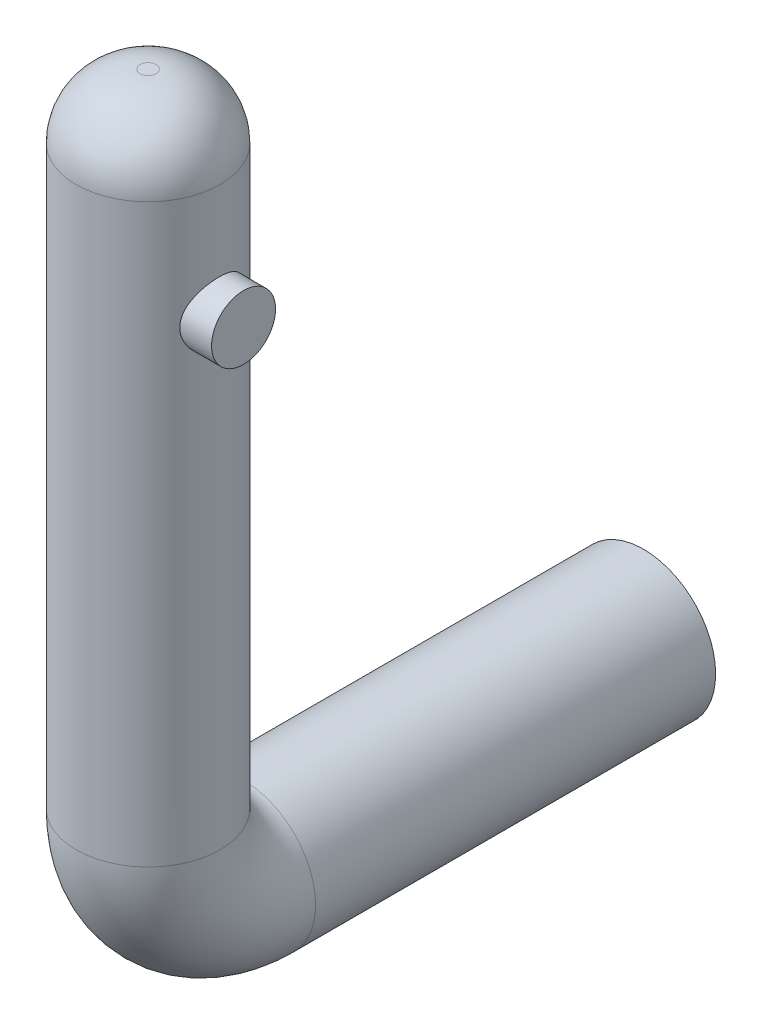
ISO-10303-21;
HEADER;
FILE_DESCRIPTION(('STEP AP214'),'2;1');
FILE_NAME('part.step','',(''),(''),'','','');
FILE_SCHEMA(('AUTOMOTIVE_DESIGN { 1 0 10303 214 1 1 1 1 }'));
ENDSEC;
DATA;
#1=APPLICATION_CONTEXT('core data for automotive mechanical design processes');
#2=APPLICATION_PROTOCOL_DEFINITION('international standard','automotive_design',2000,#1);
#3=PRODUCT_CONTEXT('',#1,'mechanical');
#4=PRODUCT('Part','Part','',(#3));
#5=PRODUCT_RELATED_PRODUCT_CATEGORY('part','',(#4));
#6=PRODUCT_DEFINITION_FORMATION('','',#4);
#7=PRODUCT_DEFINITION_CONTEXT('part definition',#1,'design');
#8=PRODUCT_DEFINITION('design','',#6,#7);
#9=PRODUCT_DEFINITION_SHAPE('','',#8);
#10=(LENGTH_UNIT() NAMED_UNIT(*) SI_UNIT(.MILLI.,.METRE.));
#11=(NAMED_UNIT(*) PLANE_ANGLE_UNIT() SI_UNIT($,.RADIAN.));
#12=(NAMED_UNIT(*) SI_UNIT($,.STERADIAN.) SOLID_ANGLE_UNIT());
#13=UNCERTAINTY_MEASURE_WITH_UNIT(LENGTH_MEASURE(1.E-05),#10,'distance_accuracy_value','');
#14=(GEOMETRIC_REPRESENTATION_CONTEXT(3) GLOBAL_UNCERTAINTY_ASSIGNED_CONTEXT((#13)) GLOBAL_UNIT_ASSIGNED_CONTEXT((#10,
#11,#12)) REPRESENTATION_CONTEXT('',''));
#15=CARTESIAN_POINT('',(0.,0.,0.));
#16=DIRECTION('',(0.,0.,1.));
#17=DIRECTION('',(1.,0.,0.));
#18=AXIS2_PLACEMENT_3D('',#15,#16,#17);
#19=CARTESIAN_POINT('',(0.,5.96477448449233,30.9647744844923));
#20=DIRECTION('',(0.,1.,0.));
#21=DIRECTION('',(0.,0.,1.));
#22=AXIS2_PLACEMENT_3D('',#19,#20,#21);
#23=CYLINDRICAL_SURFACE('',#22,4.5);
#24=CARTESIAN_POINT('',(0.,5.96477448449233,30.9647744844923));
#25=DIRECTION('',(0.,1.,0.));
#26=DIRECTION('',(1.,0.,0.));
#27=AXIS2_PLACEMENT_3D('',#24,#25,#26);
#28=CIRCLE('',#27,4.5);
#29=CARTESIAN_POINT('',(0.,5.96477448449233,35.4647744844923));
#30=VERTEX_POINT('',#29);
#31=EDGE_CURVE('E56',#30,#30,#28,.T.);
#32=ORIENTED_EDGE('',*,*,#31,.T.);
#33=EDGE_LOOP('',(#32));
#34=FACE_BOUND('',#33,.T.);
#35=CARTESIAN_POINT('',(0.,41.9647744844923,30.9647744844923));
#36=DIRECTION('',(0.,1.,0.));
#37=DIRECTION('',(0.,0.,1.));
#38=AXIS2_PLACEMENT_3D('',#35,#36,#37);
#39=CIRCLE('',#38,4.5);
#40=CARTESIAN_POINT('',(0.,41.9647744844923,35.4647744844923));
#41=VERTEX_POINT('',#40);
#42=EDGE_CURVE('E10',#41,#41,#39,.F.);
#43=ORIENTED_EDGE('',*,*,#42,.T.);
#44=EDGE_LOOP('',(#43));
#45=FACE_BOUND('',#44,.T.);
#46=CARTESIAN_POINT('',(4.01345949288473,35.,33.));
#47=CARTESIAN_POINT('',(4.01346519462913,35.1056364135838,32.9999948387698));
#48=CARTESIAN_POINT('',(4.01776516168621,35.2114449167085,32.9915765566745));
#49=CARTESIAN_POINT('',(4.03438581277662,35.4199359214425,32.958278942159));
#50=CARTESIAN_POINT('',(4.04672694018069,35.5226097552481,32.9333576508216));
#51=CARTESIAN_POINT('',(4.07774320827353,35.7214302992945,32.868268919712));
#52=CARTESIAN_POINT('',(4.09638931034859,35.8176045505512,32.8281712779045));
#53=CARTESIAN_POINT('',(4.13789521433156,36.0018278148005,32.7340844491881));
#54=CARTESIAN_POINT('',(4.16075443342319,36.0898779491078,32.6800971832745));
#55=CARTESIAN_POINT('',(4.2100156552549,36.2618644675177,32.5555409568229));
#56=CARTESIAN_POINT('',(4.23655222027747,36.3451361227007,32.4841069997539));
#57=CARTESIAN_POINT('',(4.28917057031154,36.4990184527393,32.3285047324037));
#58=CARTESIAN_POINT('',(4.31525215157186,36.569623580319,32.2443308723194));
#59=CARTESIAN_POINT('',(4.36577092335343,36.699906771846,32.0600575214527));
#60=CARTESIAN_POINT('',(4.39004188048354,36.7587831445575,31.959341391537));
#61=CARTESIAN_POINT('',(4.43259309406328,36.8584591189288,31.7481592454407));
#62=CARTESIAN_POINT('',(4.45087629601152,36.8992676120335,31.6376980571023));
#63=CARTESIAN_POINT('',(4.47853346047371,36.9592186662978,31.4168775089949));
#64=CARTESIAN_POINT('',(4.48835934424051,36.9794723169487,31.3068776708476));
#65=CARTESIAN_POINT('',(4.49977658325178,37.0013210783259,31.084637282326));
#66=CARTESIAN_POINT('',(4.50137196394682,37.0029253107635,30.9723978542816));
#67=CARTESIAN_POINT('',(4.49641518995872,36.9879482355175,30.7574350632035));
#68=CARTESIAN_POINT('',(4.49043722233881,36.9726585262492,30.6546049278683));
#69=CARTESIAN_POINT('',(4.47196160311212,36.926550570551,30.453112370401));
#70=CARTESIAN_POINT('',(4.45946353994232,36.8957313438672,30.354450211786));
#71=CARTESIAN_POINT('',(4.42900051123402,36.8192118796153,30.1625802759012));
#72=CARTESIAN_POINT('',(4.41097036320376,36.7733337324258,30.0694542552073));
#73=CARTESIAN_POINT('',(4.37119638507397,36.668203054629,29.8919617877282));
#74=CARTESIAN_POINT('',(4.34945123965074,36.6089457846416,29.8075984605127));
#75=CARTESIAN_POINT('',(4.30245214573802,36.4734588174428,29.6431184937504));
#76=CARTESIAN_POINT('',(4.27705695611399,36.396274053271,29.5638279996904));
#77=CARTESIAN_POINT('',(4.22684217198236,36.229773388432,29.4189091942512));
#78=CARTESIAN_POINT('',(4.2020228631422,36.1404516116697,29.353287539818));
#79=CARTESIAN_POINT('',(4.15472817395428,35.9474978657467,29.2348964441824));
#80=CARTESIAN_POINT('',(4.13239747162146,35.8434187024977,29.1827927077292));
#81=CARTESIAN_POINT('',(4.09442392645219,35.6267493632274,29.0971796182504));
#82=CARTESIAN_POINT('',(4.07877589076233,35.5141658759627,29.0636558213854));
#83=CARTESIAN_POINT('',(4.05734336557172,35.2916918716887,29.0183529605436));
#84=CARTESIAN_POINT('',(4.05096882875927,35.1821254101199,29.0052687456195));
#85=CARTESIAN_POINT('',(4.04712399466954,34.9621988005173,28.997335785751));
#86=CARTESIAN_POINT('',(4.04964990508082,34.8518390105036,29.0024792743338));
#87=CARTESIAN_POINT('',(4.06268994687931,34.6421973082896,29.0296414685902));
#88=CARTESIAN_POINT('',(4.07259188806472,34.5427045884886,29.0503679938395));
#89=CARTESIAN_POINT('',(4.09842484543083,34.3487165418169,29.1063192564061));
#90=CARTESIAN_POINT('',(4.11435737804313,34.2542224787083,29.1415476405059));
#91=CARTESIAN_POINT('',(4.1512577833575,34.0683639604923,29.2271574753337));
#92=CARTESIAN_POINT('',(4.17241216491621,33.9773071075272,29.2781235467601));
#93=CARTESIAN_POINT('',(4.21711156024752,33.8045726583425,29.3932216745549));
#94=CARTESIAN_POINT('',(4.24065767460644,33.7228994172876,29.4573598062129));
#95=CARTESIAN_POINT('',(4.29004205669084,33.5634741341769,29.6038785501386));
#96=CARTESIAN_POINT('',(4.31589329204679,33.4867612087078,29.6873901721799));
#97=CARTESIAN_POINT('',(4.36495271115786,33.3482089757321,29.8666772313915));
#98=CARTESIAN_POINT('',(4.38816058417893,33.2863714159147,29.9624541075686));
#99=CARTESIAN_POINT('',(4.42950660284072,33.1791801617899,30.164667165603));
#100=CARTESIAN_POINT('',(4.44761281576643,33.1339297831618,30.2711650602544));
#101=CARTESIAN_POINT('',(4.47639112756342,33.0623306977321,30.4912705172366));
#102=CARTESIAN_POINT('',(4.48706825835924,33.0359691966056,30.6048732103372));
#103=CARTESIAN_POINT('',(4.49913943214775,33.0046396978973,30.8265312088265));
#104=CARTESIAN_POINT('',(4.50118376981361,32.9981834172731,30.9343419838128));
#105=CARTESIAN_POINT('',(4.49749440594191,33.0026943283505,31.1494506005005));
#106=CARTESIAN_POINT('',(4.49176229102372,33.0136579659672,31.2567485423527));
#107=CARTESIAN_POINT('',(4.47346884273418,33.0516541624432,31.4631475939733));
#108=CARTESIAN_POINT('',(4.46120244932753,33.0779971317532,31.5624039122824));
#109=CARTESIAN_POINT('',(4.43114830167378,33.1451671610599,31.7549844295639));
#110=CARTESIAN_POINT('',(4.41335953761756,33.1859968702668,31.848307539839));
#111=CARTESIAN_POINT('',(4.37282956992299,33.283148651655,32.0313442129576));
#112=CARTESIAN_POINT('',(4.3498909975466,33.3401225582493,32.1206670275562));
#113=CARTESIAN_POINT('',(4.30168073746322,33.4670472563,32.2888630958271));
#114=CARTESIAN_POINT('',(4.27640803368521,33.5370037126938,32.3677317619776));
#115=CARTESIAN_POINT('',(4.22376909518507,33.6944582291721,32.5193544919871));
#116=CARTESIAN_POINT('',(4.19639664854251,33.7829103416021,32.5911191986376));
#117=CARTESIAN_POINT('',(4.14457679045623,33.9713822158539,32.7189862495311));
#118=CARTESIAN_POINT('',(4.12013119873973,34.0714090989018,32.7750788785014));
#119=CARTESIAN_POINT('',(4.07720525931918,34.2809079003256,32.8697998292258));
#120=CARTESIAN_POINT('',(4.05873748158843,34.3903991156976,32.9083914177162));
#121=CARTESIAN_POINT('',(4.03062508920332,34.6152828645872,32.9660546304597));
#122=CARTESIAN_POINT('',(4.02095037248396,34.7306538256739,32.985192877906));
#123=CARTESIAN_POINT('',(4.01544368443717,34.8722646786837,32.9960818866396));
#124=CARTESIAN_POINT('',(4.0147012187954,34.8977808452801,32.9975496973505));
#125=CARTESIAN_POINT('',(4.01370842565377,34.9488613115186,32.9995093930199));
#126=CARTESIAN_POINT('',(4.01345811250257,34.9744256125422,33.0000012495246));
#127=CARTESIAN_POINT('',(4.01345949288473,35.,33.));
#128=B_SPLINE_CURVE_WITH_KNOTS('',3,(#46,#47,#48,#49,#50,#51,#52,#53,#54,#55,#56,#57,#58,#59,
#60,#61,#62,#63,#64,#65,#66,#67,#68,#69,#70,#71,#72,#73,#74,#75,#76,#77,#78,#79,#80,#81,#82,#83,
#84,#85,#86,#87,#88,#89,#90,#91,#92,#93,#94,#95,#96,#97,#98,#99,#100,#101,#102,#103,#104,#105,
#106,#107,#108,#109,#110,#111,#112,#113,#114,#115,#116,#117,#118,#119,#120,#121,#122,#123,#124,
#125,#126,#127),.UNSPECIFIED.,.T.,.F.,(4,2,2,2,2,2,2,2,2,2,2,2,2,2,2,2,2,2,2,2,2,2,2,2,2,2,2,2,
2,2,2,2,2,2,2,2,2,2,2,2,4),(0.,0.31680123245099,0.634411040877782,0.950577529894168,
1.26670031519621,1.60388089863025,1.94120879092773,2.29685672910723,2.65232945312278,
2.98735785670008,3.32222238594224,3.63315280046274,3.94410284398229,4.25886735387032,
4.57374354041936,4.9128461981172,5.25211362014339,5.60581751332236,5.95924605394312,
6.28902064612217,6.61865474460758,6.92361098740476,7.22864396443949,7.54674748945714,
7.86499806275925,8.21231012237269,8.55966296736818,8.90914399580831,9.25838807996274,
9.5807951471654,9.9031364439718,10.2120275494092,10.5209751713308,10.8448129921039,
11.1687924532308,11.5186111485495,11.8686462211334,12.2194126265922,12.5689736490767,
12.645668426838,12.7223654405944),.UNSPECIFIED.);
#129=CARTESIAN_POINT('',(4.01345949288473,35.,33.));
#130=VERTEX_POINT('',#129);
#131=EDGE_CURVE('E41',#130,#130,#128,.T.);
#132=ORIENTED_EDGE('',*,*,#131,.T.);
#133=EDGE_LOOP('',(#132));
#134=FACE_BOUND('',#133,.T.);
#135=ADVANCED_FACE('F37',(#34,#45,#134),#23,.T.);
#136=CARTESIAN_POINT('',(0.,0.,0.));
#137=DIRECTION('',(0.,0.,1.));
#138=DIRECTION('',(1.,0.,0.));
#139=AXIS2_PLACEMENT_3D('',#136,#137,#138);
#140=PLANE('',#139);
#141=CARTESIAN_POINT('',(0.,0.,0.));
#142=DIRECTION('',(0.,0.,1.));
#143=DIRECTION('',(1.,0.,0.));
#144=AXIS2_PLACEMENT_3D('',#141,#142,#143);
#145=CIRCLE('',#144,4.5);
#146=CARTESIAN_POINT('',(4.5,0.,0.));
#147=VERTEX_POINT('',#146);
#148=EDGE_CURVE('E66',#147,#147,#145,.T.);
#149=ORIENTED_EDGE('',*,*,#148,.F.);
#150=EDGE_LOOP('',(#149));
#151=FACE_BOUND('',#150,.T.);
#152=ADVANCED_FACE('F92',(#151),#140,.F.);
#153=CARTESIAN_POINT('',(0.,45.9647744844923,30.9647744844923));
#154=DIRECTION('',(0.,1.,0.));
#155=DIRECTION('',(1.,0.,0.));
#156=AXIS2_PLACEMENT_3D('',#153,#154,#155);
#157=PLANE('',#156);
#158=CARTESIAN_POINT('',(0.,45.9647744844923,30.9647744844923));
#159=DIRECTION('',(0.,1.,0.));
#160=DIRECTION('',(0.,0.,1.));
#161=AXIS2_PLACEMENT_3D('',#158,#159,#160);
#162=CIRCLE('',#161,0.5);
#163=CARTESIAN_POINT('',(0.,45.9647744844923,31.4647744844923));
#164=VERTEX_POINT('',#163);
#165=EDGE_CURVE('E51',#164,#164,#162,.T.);
#166=ORIENTED_EDGE('',*,*,#165,.T.);
#167=EDGE_LOOP('',(#166));
#168=FACE_BOUND('',#167,.T.);
#169=ADVANCED_FACE('F101',(#168),#157,.T.);
#170=CARTESIAN_POINT('',(0.,0.,0.));
#171=DIRECTION('',(0.,0.,1.));
#172=DIRECTION('',(0.,-1.,0.));
#173=AXIS2_PLACEMENT_3D('',#170,#171,#172);
#174=CYLINDRICAL_SURFACE('',#173,4.5);
#175=CARTESIAN_POINT('',(0.,0.,25.));
#176=DIRECTION('',(0.,0.,1.));
#177=DIRECTION('',(1.,0.,0.));
#178=AXIS2_PLACEMENT_3D('',#175,#176,#177);
#179=CIRCLE('',#178,4.5);
#180=CARTESIAN_POINT('',(0.,-4.5,25.));
#181=VERTEX_POINT('',#180);
#182=EDGE_CURVE('E62',#181,#181,#179,.T.);
#183=ORIENTED_EDGE('',*,*,#182,.F.);
#184=EDGE_LOOP('',(#183));
#185=FACE_BOUND('',#184,.T.);
#186=ORIENTED_EDGE('',*,*,#148,.T.);
#187=EDGE_LOOP('',(#186));
#188=FACE_BOUND('',#187,.T.);
#189=ADVANCED_FACE('F107',(#185,#188),#174,.T.);
#190=CARTESIAN_POINT('',(0.,5.96477448449233,25.));
#191=DIRECTION('',(-1.,0.,0.));
#192=DIRECTION('',(0.,0.,1.));
#193=AXIS2_PLACEMENT_3D('',#190,#191,#192);
#194=TOROIDAL_SURFACE('',#193,5.96477448449233,4.5);
#195=CARTESIAN_POINT('',(0.,5.96477448449233,25.));
#196=DIRECTION('',(-1.,0.,0.));
#197=DIRECTION('',(0.,0.,1.));
#198=AXIS2_PLACEMENT_3D('',#195,#196,#197);
#199=CIRCLE('',#198,10.4647744844923);
#200=EDGE_CURVE('',#181,#30,#199,.T.);
#201=ORIENTED_EDGE('',*,*,#182,.T.);
#202=ORIENTED_EDGE('',*,*,#31,.F.);
#203=ORIENTED_EDGE('',*,*,#200,.T.);
#204=ORIENTED_EDGE('',*,*,#200,.F.);
#205=EDGE_LOOP('',(#201,#203,#202,#204));
#206=FACE_BOUND('',#205,.T.);
#207=ADVANCED_FACE('F90',(#206),#194,.T.);
#208=CARTESIAN_POINT('',(0.,41.9647744844923,30.9647744844923));
#209=DIRECTION('',(0.,1.,0.));
#210=DIRECTION('',(0.,0.,1.));
#211=AXIS2_PLACEMENT_3D('',#208,#209,#210);
#212=DEGENERATE_TOROIDAL_SURFACE('',#211,0.5,4.,.T.);
#213=ORIENTED_EDGE('',*,*,#42,.F.);
#214=EDGE_LOOP('',(#213));
#215=FACE_BOUND('',#214,.T.);
#216=ORIENTED_EDGE('',*,*,#165,.F.);
#217=EDGE_LOOP('',(#216));
#218=FACE_BOUND('',#217,.T.);
#219=ADVANCED_FACE('F39',(#215,#218),#212,.T.);
#220=CARTESIAN_POINT('',(6.,35.,31.));
#221=DIRECTION('',(-1.,0.,0.));
#222=DIRECTION('',(0.,0.,1.));
#223=AXIS2_PLACEMENT_3D('',#220,#221,#222);
#224=CYLINDRICAL_SURFACE('',#223,2.00000000000001);
#225=ORIENTED_EDGE('',*,*,#131,.F.);
#226=EDGE_LOOP('',(#225));
#227=FACE_BOUND('',#226,.T.);
#228=CARTESIAN_POINT('',(6.,35.,31.));
#229=DIRECTION('',(1.,0.,0.));
#230=DIRECTION('',(0.,0.,-1.));
#231=AXIS2_PLACEMENT_3D('',#228,#229,#230);
#232=CIRCLE('',#231,2.00000000000001);
#233=CARTESIAN_POINT('',(6.,35.,29.));
#234=VERTEX_POINT('',#233);
#235=EDGE_CURVE('E70',#234,#234,#232,.T.);
#236=ORIENTED_EDGE('',*,*,#235,.F.);
#237=EDGE_LOOP('',(#236));
#238=FACE_BOUND('',#237,.T.);
#239=ADVANCED_FACE('F80',(#227,#238),#224,.T.);
#240=CARTESIAN_POINT('',(6.,35.,31.));
#241=DIRECTION('',(1.,0.,0.));
#242=DIRECTION('',(0.,0.,-1.));
#243=AXIS2_PLACEMENT_3D('',#240,#241,#242);
#244=PLANE('',#243);
#245=ORIENTED_EDGE('',*,*,#235,.T.);
#246=EDGE_LOOP('',(#245));
#247=FACE_BOUND('',#246,.T.);
#248=ADVANCED_FACE('F83',(#247),#244,.T.);
#249=CLOSED_SHELL('',(#135,#152,#169,#189,#207,#219,#239,#248));
#250=MANIFOLD_SOLID_BREP('B2',#249);
#251=ADVANCED_BREP_SHAPE_REPRESENTATION('',(#18,#250),#14);
#252=SHAPE_DEFINITION_REPRESENTATION(#9,#251);
ENDSEC;
END-ISO-10303-21;
